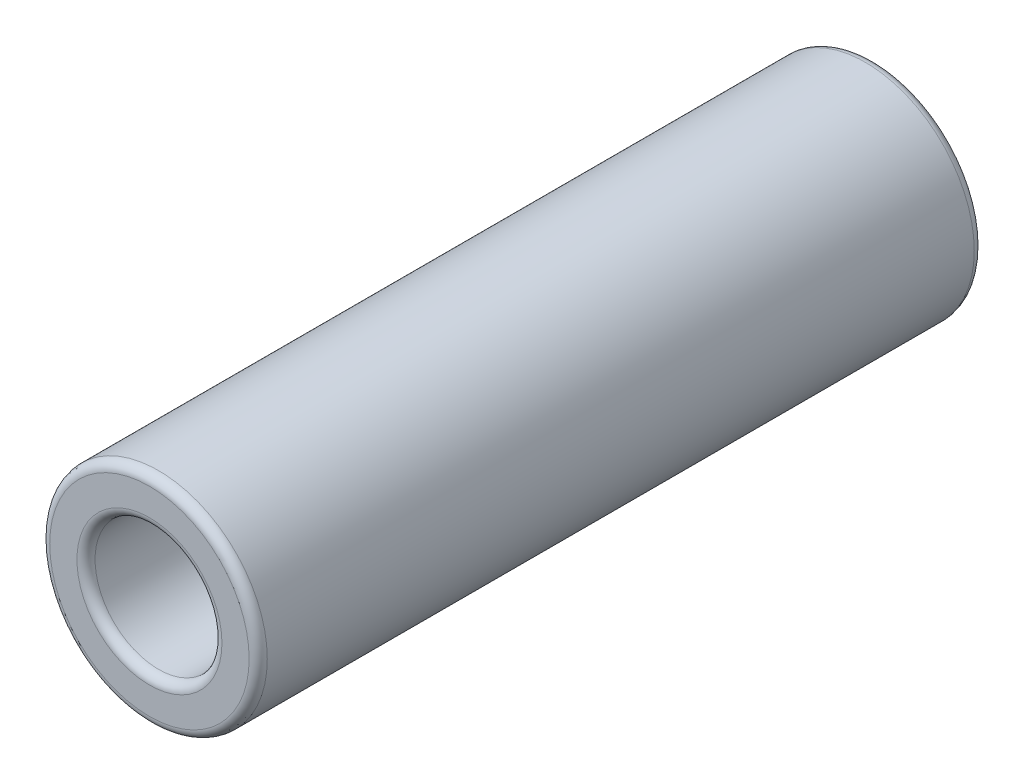
ISO-10303-21;
HEADER;
FILE_DESCRIPTION(('STEP AP214'),'2;1');
FILE_NAME('part.step','',(''),(''),'','','');
FILE_SCHEMA(('AUTOMOTIVE_DESIGN { 1 0 10303 214 1 1 1 1 }'));
ENDSEC;
DATA;
#1=APPLICATION_CONTEXT('core data for automotive mechanical design processes');
#2=APPLICATION_PROTOCOL_DEFINITION('international standard','automotive_design',2000,#1);
#3=PRODUCT_CONTEXT('',#1,'mechanical');
#4=PRODUCT('Part','Part','',(#3));
#5=PRODUCT_RELATED_PRODUCT_CATEGORY('part','',(#4));
#6=PRODUCT_DEFINITION_FORMATION('','',#4);
#7=PRODUCT_DEFINITION_CONTEXT('part definition',#1,'design');
#8=PRODUCT_DEFINITION('design','',#6,#7);
#9=PRODUCT_DEFINITION_SHAPE('','',#8);
#10=(LENGTH_UNIT() NAMED_UNIT(*) SI_UNIT(.MILLI.,.METRE.));
#11=(NAMED_UNIT(*) PLANE_ANGLE_UNIT() SI_UNIT($,.RADIAN.));
#12=(NAMED_UNIT(*) SI_UNIT($,.STERADIAN.) SOLID_ANGLE_UNIT());
#13=UNCERTAINTY_MEASURE_WITH_UNIT(LENGTH_MEASURE(1.E-05),#10,'distance_accuracy_value','');
#14=(GEOMETRIC_REPRESENTATION_CONTEXT(3) GLOBAL_UNCERTAINTY_ASSIGNED_CONTEXT((#13)) GLOBAL_UNIT_ASSIGNED_CONTEXT((#10,
#11,#12)) REPRESENTATION_CONTEXT('',''));
#15=CARTESIAN_POINT('',(0.,0.,0.));
#16=DIRECTION('',(0.,0.,1.));
#17=DIRECTION('',(1.,0.,0.));
#18=AXIS2_PLACEMENT_3D('',#15,#16,#17);
#19=CARTESIAN_POINT('',(0.,0.,40.));
#20=DIRECTION('',(0.,0.,1.));
#21=DIRECTION('',(1.,0.,0.));
#22=AXIS2_PLACEMENT_3D('',#19,#20,#21);
#23=PLANE('',#22);
#24=CARTESIAN_POINT('',(0.,0.,40.));
#25=DIRECTION('',(0.,0.,1.));
#26=DIRECTION('',(1.,0.,0.));
#27=AXIS2_PLACEMENT_3D('',#24,#25,#26);
#28=CIRCLE('',#27,4.);
#29=CARTESIAN_POINT('',(4.,0.,40.));
#30=VERTEX_POINT('',#29);
#31=EDGE_CURVE('E10',#30,#30,#28,.F.);
#32=ORIENTED_EDGE('',*,*,#31,.T.);
#33=EDGE_LOOP('',(#32));
#34=FACE_BOUND('',#33,.T.);
#35=CARTESIAN_POINT('',(0.,0.,40.));
#36=DIRECTION('',(0.,0.,1.));
#37=DIRECTION('',(1.,0.,0.));
#38=AXIS2_PLACEMENT_3D('',#35,#36,#37);
#39=CIRCLE('',#38,5.5);
#40=CARTESIAN_POINT('',(5.5,0.,40.));
#41=VERTEX_POINT('',#40);
#42=EDGE_CURVE('E45',#41,#41,#39,.T.);
#43=ORIENTED_EDGE('',*,*,#42,.T.);
#44=EDGE_LOOP('',(#43));
#45=FACE_BOUND('',#44,.T.);
#46=ADVANCED_FACE('F37',(#34,#45),#23,.T.);
#47=CARTESIAN_POINT('',(0.,0.,0.));
#48=DIRECTION('',(0.,0.,1.));
#49=DIRECTION('',(1.,0.,0.));
#50=AXIS2_PLACEMENT_3D('',#47,#48,#49);
#51=PLANE('',#50);
#52=CARTESIAN_POINT('',(0.,0.,0.));
#53=DIRECTION('',(0.,0.,1.));
#54=DIRECTION('',(1.,0.,0.));
#55=AXIS2_PLACEMENT_3D('',#52,#53,#54);
#56=CIRCLE('',#55,4.);
#57=CARTESIAN_POINT('',(4.,0.,0.));
#58=VERTEX_POINT('',#57);
#59=EDGE_CURVE('E69',#58,#58,#56,.T.);
#60=ORIENTED_EDGE('',*,*,#59,.T.);
#61=EDGE_LOOP('',(#60));
#62=FACE_BOUND('',#61,.T.);
#63=CARTESIAN_POINT('',(0.,0.,0.));
#64=DIRECTION('',(0.,0.,1.));
#65=DIRECTION('',(1.,0.,0.));
#66=AXIS2_PLACEMENT_3D('',#63,#64,#65);
#67=CIRCLE('',#66,5.5);
#68=CARTESIAN_POINT('',(5.5,0.,0.));
#69=VERTEX_POINT('',#68);
#70=EDGE_CURVE('E73',#69,#69,#67,.F.);
#71=ORIENTED_EDGE('',*,*,#70,.T.);
#72=EDGE_LOOP('',(#71));
#73=FACE_BOUND('',#72,.T.);
#74=ADVANCED_FACE('F78',(#62,#73),#51,.F.);
#75=CARTESIAN_POINT('',(0.,0.,40.));
#76=DIRECTION('',(0.,0.,-1.));
#77=DIRECTION('',(-1.,0.,0.));
#78=AXIS2_PLACEMENT_3D('',#75,#76,#77);
#79=CYLINDRICAL_SURFACE('',#78,6.);
#80=CARTESIAN_POINT('',(0.,0.,0.5));
#81=DIRECTION('',(0.,0.,1.));
#82=DIRECTION('',(1.,0.,0.));
#83=AXIS2_PLACEMENT_3D('',#80,#81,#82);
#84=CIRCLE('',#83,6.);
#85=CARTESIAN_POINT('',(6.,0.,0.5));
#86=VERTEX_POINT('',#85);
#87=EDGE_CURVE('E50',#86,#86,#84,.T.);
#88=ORIENTED_EDGE('',*,*,#87,.T.);
#89=EDGE_LOOP('',(#88));
#90=FACE_BOUND('',#89,.T.);
#91=CARTESIAN_POINT('',(0.,0.,39.5));
#92=DIRECTION('',(0.,0.,1.));
#93=DIRECTION('',(1.,0.,0.));
#94=AXIS2_PLACEMENT_3D('',#91,#92,#93);
#95=CIRCLE('',#94,6.);
#96=CARTESIAN_POINT('',(6.,0.,39.5));
#97=VERTEX_POINT('',#96);
#98=EDGE_CURVE('E55',#97,#97,#95,.F.);
#99=ORIENTED_EDGE('',*,*,#98,.T.);
#100=EDGE_LOOP('',(#99));
#101=FACE_BOUND('',#100,.T.);
#102=ADVANCED_FACE('F88',(#90,#101),#79,.T.);
#103=CARTESIAN_POINT('',(0.,0.,40.));
#104=DIRECTION('',(0.,0.,-1.));
#105=DIRECTION('',(-1.,0.,0.));
#106=AXIS2_PLACEMENT_3D('',#103,#104,#105);
#107=CYLINDRICAL_SURFACE('',#106,3.5);
#108=CARTESIAN_POINT('',(0.,0.,0.5));
#109=DIRECTION('',(0.,0.,1.));
#110=DIRECTION('',(1.,0.,0.));
#111=AXIS2_PLACEMENT_3D('',#108,#109,#110);
#112=CIRCLE('',#111,3.5);
#113=CARTESIAN_POINT('',(3.5,0.,0.5));
#114=VERTEX_POINT('',#113);
#115=EDGE_CURVE('E61',#114,#114,#112,.F.);
#116=ORIENTED_EDGE('',*,*,#115,.T.);
#117=EDGE_LOOP('',(#116));
#118=FACE_BOUND('',#117,.T.);
#119=CARTESIAN_POINT('',(0.,0.,39.5));
#120=DIRECTION('',(0.,0.,1.));
#121=DIRECTION('',(1.,0.,0.));
#122=AXIS2_PLACEMENT_3D('',#119,#120,#121);
#123=CIRCLE('',#122,3.5);
#124=CARTESIAN_POINT('',(3.5,0.,39.5));
#125=VERTEX_POINT('',#124);
#126=EDGE_CURVE('E65',#125,#125,#123,.T.);
#127=ORIENTED_EDGE('',*,*,#126,.T.);
#128=EDGE_LOOP('',(#127));
#129=FACE_BOUND('',#128,.T.);
#130=ADVANCED_FACE('F91',(#118,#129),#107,.F.);
#131=CARTESIAN_POINT('',(0.,0.,0.5));
#132=DIRECTION('',(0.,0.,1.));
#133=DIRECTION('',(1.,0.,0.));
#134=AXIS2_PLACEMENT_3D('',#131,#132,#133);
#135=TOROIDAL_SURFACE('',#134,4.,0.5);
#136=ORIENTED_EDGE('',*,*,#115,.F.);
#137=EDGE_LOOP('',(#136));
#138=FACE_BOUND('',#137,.T.);
#139=ORIENTED_EDGE('',*,*,#59,.F.);
#140=EDGE_LOOP('',(#139));
#141=FACE_BOUND('',#140,.T.);
#142=ADVANCED_FACE('F84',(#138,#141),#135,.T.);
#143=CARTESIAN_POINT('',(0.,0.,0.5));
#144=DIRECTION('',(0.,0.,1.));
#145=DIRECTION('',(1.,0.,0.));
#146=AXIS2_PLACEMENT_3D('',#143,#144,#145);
#147=TOROIDAL_SURFACE('',#146,5.5,0.5);
#148=ORIENTED_EDGE('',*,*,#70,.F.);
#149=EDGE_LOOP('',(#148));
#150=FACE_BOUND('',#149,.T.);
#151=ORIENTED_EDGE('',*,*,#87,.F.);
#152=EDGE_LOOP('',(#151));
#153=FACE_BOUND('',#152,.T.);
#154=ADVANCED_FACE('F80',(#150,#153),#147,.T.);
#155=CARTESIAN_POINT('',(0.,0.,39.5));
#156=DIRECTION('',(0.,0.,1.));
#157=DIRECTION('',(1.,0.,0.));
#158=AXIS2_PLACEMENT_3D('',#155,#156,#157);
#159=TOROIDAL_SURFACE('',#158,4.,0.5);
#160=ORIENTED_EDGE('',*,*,#31,.F.);
#161=EDGE_LOOP('',(#160));
#162=FACE_BOUND('',#161,.T.);
#163=ORIENTED_EDGE('',*,*,#126,.F.);
#164=EDGE_LOOP('',(#163));
#165=FACE_BOUND('',#164,.T.);
#166=ADVANCED_FACE('F83',(#162,#165),#159,.T.);
#167=CARTESIAN_POINT('',(0.,0.,39.5));
#168=DIRECTION('',(0.,0.,1.));
#169=DIRECTION('',(1.,0.,0.));
#170=AXIS2_PLACEMENT_3D('',#167,#168,#169);
#171=TOROIDAL_SURFACE('',#170,5.5,0.5);
#172=ORIENTED_EDGE('',*,*,#98,.F.);
#173=EDGE_LOOP('',(#172));
#174=FACE_BOUND('',#173,.T.);
#175=ORIENTED_EDGE('',*,*,#42,.F.);
#176=EDGE_LOOP('',(#175));
#177=FACE_BOUND('',#176,.T.);
#178=ADVANCED_FACE('F39',(#174,#177),#171,.T.);
#179=CLOSED_SHELL('',(#46,#74,#102,#130,#142,#154,#166,#178));
#180=MANIFOLD_SOLID_BREP('B2',#179);
#181=ADVANCED_BREP_SHAPE_REPRESENTATION('',(#18,#180),#14);
#182=SHAPE_DEFINITION_REPRESENTATION(#9,#181);
ENDSEC;
END-ISO-10303-21;
